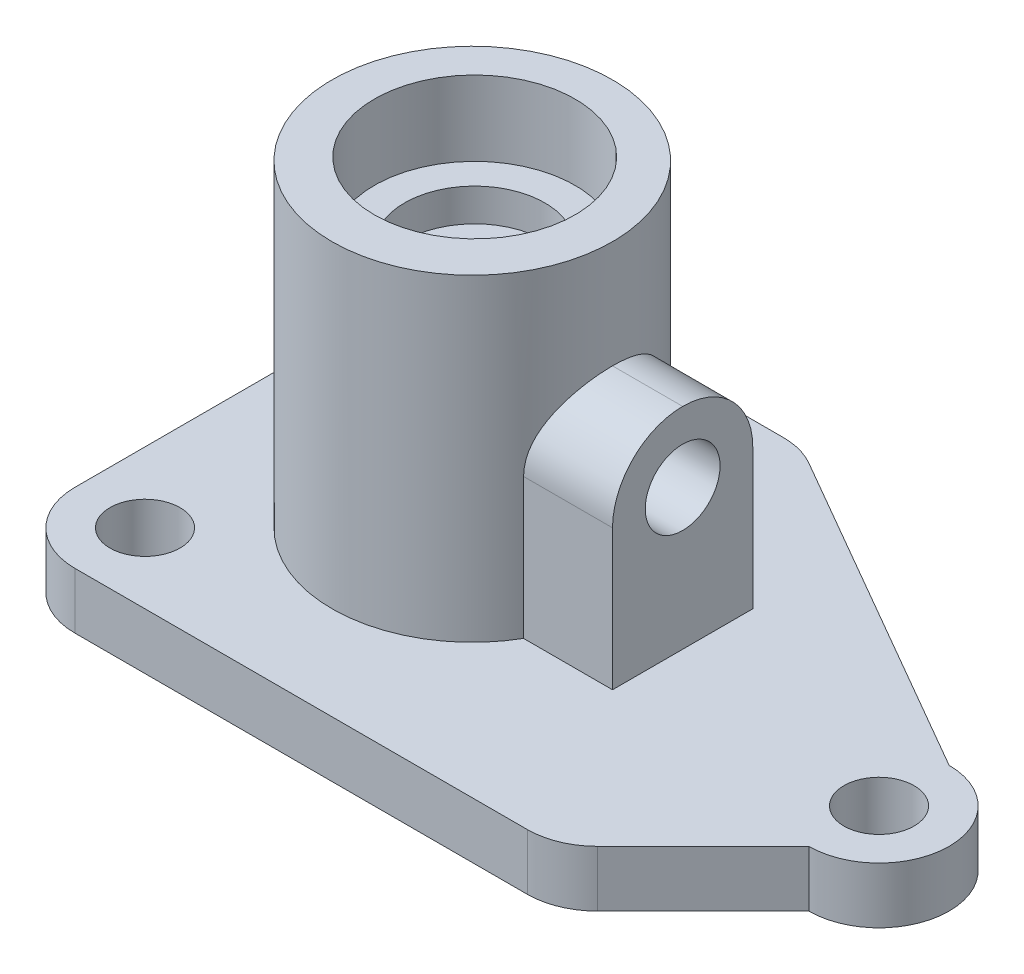
ISO-10303-21;
HEADER;
FILE_DESCRIPTION(('STEP AP214'),'2;1');
FILE_NAME('part.step','',(''),(''),'','','');
FILE_SCHEMA(('AUTOMOTIVE_DESIGN { 1 0 10303 214 1 1 1 1 }'));
ENDSEC;
DATA;
#1=APPLICATION_CONTEXT('core data for automotive mechanical design processes');
#2=APPLICATION_PROTOCOL_DEFINITION('international standard','automotive_design',2000,#1);
#3=PRODUCT_CONTEXT('',#1,'mechanical');
#4=PRODUCT('Part','Part','',(#3));
#5=PRODUCT_RELATED_PRODUCT_CATEGORY('part','',(#4));
#6=PRODUCT_DEFINITION_FORMATION('','',#4);
#7=PRODUCT_DEFINITION_CONTEXT('part definition',#1,'design');
#8=PRODUCT_DEFINITION('design','',#6,#7);
#9=PRODUCT_DEFINITION_SHAPE('','',#8);
#10=(LENGTH_UNIT() NAMED_UNIT(*) SI_UNIT(.MILLI.,.METRE.));
#11=(NAMED_UNIT(*) PLANE_ANGLE_UNIT() SI_UNIT($,.RADIAN.));
#12=(NAMED_UNIT(*) SI_UNIT($,.STERADIAN.) SOLID_ANGLE_UNIT());
#13=UNCERTAINTY_MEASURE_WITH_UNIT(LENGTH_MEASURE(1.E-05),#10,'distance_accuracy_value','');
#14=(GEOMETRIC_REPRESENTATION_CONTEXT(3) GLOBAL_UNCERTAINTY_ASSIGNED_CONTEXT((#13)) GLOBAL_UNIT_ASSIGNED_CONTEXT((#10,
#11,#12)) REPRESENTATION_CONTEXT('',''));
#15=CARTESIAN_POINT('',(0.,0.,0.));
#16=DIRECTION('',(0.,0.,1.));
#17=DIRECTION('',(1.,0.,0.));
#18=AXIS2_PLACEMENT_3D('',#15,#16,#17);
#19=CARTESIAN_POINT('',(49.557906347323,-6.00000000000001,-50.9678122259524));
#20=DIRECTION('',(0.,1.,0.));
#21=DIRECTION('',(0.,0.,1.));
#22=AXIS2_PLACEMENT_3D('',#19,#20,#21);
#23=CYLINDRICAL_SURFACE('',#22,15.);
#24=CARTESIAN_POINT('',(49.557906347323,-6.00000000000001,-50.9678122259524));
#25=DIRECTION('',(0.,1.,0.));
#26=DIRECTION('',(0.,0.,1.));
#27=AXIS2_PLACEMENT_3D('',#24,#25,#26);
#28=CIRCLE('',#27,15.);
#29=CARTESIAN_POINT('',(49.557906347323,-6.00000000000001,-35.9678122259524));
#30=VERTEX_POINT('',#29);
#31=EDGE_CURVE('E192',#30,#30,#28,.T.);
#32=ORIENTED_EDGE('',*,*,#31,.F.);
#33=EDGE_LOOP('',(#32));
#34=FACE_BOUND('',#33,.T.);
#35=CARTESIAN_POINT('',(49.557906347323,6.,-50.9678122259524));
#36=DIRECTION('',(0.,1.,0.));
#37=DIRECTION('',(0.,0.,1.));
#38=AXIS2_PLACEMENT_3D('',#35,#36,#37);
#39=CIRCLE('',#38,15.);
#40=CARTESIAN_POINT('',(49.557906347323,6.,-35.9678122259524));
#41=VERTEX_POINT('',#40);
#42=EDGE_CURVE('E175',#41,#41,#39,.F.);
#43=ORIENTED_EDGE('',*,*,#42,.F.);
#44=EDGE_LOOP('',(#43));
#45=FACE_BOUND('',#44,.T.);
#46=ADVANCED_FACE('F41',(#34,#45),#23,.F.);
#47=CARTESIAN_POINT('',(15.,6.,-15.));
#48=DIRECTION('',(0.,-1.,0.));
#49=DIRECTION('',(0.,0.,-1.));
#50=AXIS2_PLACEMENT_3D('',#47,#48,#49);
#51=PLANE('',#50);
#52=CARTESIAN_POINT('',(15.,6.,-15.));
#53=DIRECTION('',(0.,1.,0.));
#54=DIRECTION('',(0.,0.,1.));
#55=AXIS2_PLACEMENT_3D('',#52,#53,#54);
#56=CIRCLE('',#55,7.5);
#57=CARTESIAN_POINT('',(15.,6.,-7.5));
#58=VERTEX_POINT('',#57);
#59=EDGE_CURVE('E380',#58,#58,#56,.T.);
#60=ORIENTED_EDGE('',*,*,#59,.F.);
#61=EDGE_LOOP('',(#60));
#62=FACE_BOUND('',#61,.T.);
#63=CARTESIAN_POINT('',(15.,6.,-85.));
#64=DIRECTION('',(0.,1.,0.));
#65=DIRECTION('',(0.,0.,1.));
#66=AXIS2_PLACEMENT_3D('',#63,#64,#65);
#67=CIRCLE('',#66,7.5);
#68=CARTESIAN_POINT('',(15.,6.,-77.5));
#69=VERTEX_POINT('',#68);
#70=EDGE_CURVE('E387',#69,#69,#67,.T.);
#71=ORIENTED_EDGE('',*,*,#70,.F.);
#72=EDGE_LOOP('',(#71));
#73=FACE_BOUND('',#72,.T.);
#74=CARTESIAN_POINT('',(145.,6.,-42.));
#75=DIRECTION('',(0.,1.,0.));
#76=DIRECTION('',(0.,0.,1.));
#77=AXIS2_PLACEMENT_3D('',#74,#75,#76);
#78=CIRCLE('',#77,7.50000000000001);
#79=CARTESIAN_POINT('',(145.,6.,-34.5));
#80=VERTEX_POINT('',#79);
#81=EDGE_CURVE('E395',#80,#80,#78,.T.);
#82=ORIENTED_EDGE('',*,*,#81,.F.);
#83=EDGE_LOOP('',(#82));
#84=FACE_BOUND('',#83,.T.);
#85=CARTESIAN_POINT('',(15.,6.,-15.));
#86=DIRECTION('',(0.,1.,0.));
#87=DIRECTION('',(0.,0.,-1.));
#88=AXIS2_PLACEMENT_3D('',#85,#86,#87);
#89=CIRCLE('',#88,15.);
#90=CARTESIAN_POINT('',(0.,6.,-15.0000000000001));
#91=VERTEX_POINT('',#90);
#92=CARTESIAN_POINT('',(15.0000000000001,6.,0.));
#93=VERTEX_POINT('',#92);
#94=EDGE_CURVE('E403',#91,#93,#89,.T.);
#95=ORIENTED_EDGE('',*,*,#94,.T.);
#96=DIRECTION('',(1.,0.,0.));
#97=VECTOR('',#96,1.);
#98=CARTESIAN_POINT('',(15.0000000000001,6.,0.));
#99=LINE('',#98,#97);
#100=CARTESIAN_POINT('',(111.786796564404,6.,0.));
#101=VERTEX_POINT('',#100);
#102=EDGE_CURVE('E407',#93,#101,#99,.T.);
#103=ORIENTED_EDGE('',*,*,#102,.T.);
#104=CARTESIAN_POINT('',(111.786796564404,6.,-15.));
#105=DIRECTION('',(0.,1.,0.));
#106=DIRECTION('',(0.,0.,-1.));
#107=AXIS2_PLACEMENT_3D('',#104,#105,#106);
#108=CIRCLE('',#107,15.);
#109=CARTESIAN_POINT('',(122.393398282202,6.,-4.3933982822018));
#110=VERTEX_POINT('',#109);
#111=EDGE_CURVE('E411',#101,#110,#108,.T.);
#112=ORIENTED_EDGE('',*,*,#111,.T.);
#113=DIRECTION('',(0.707106781186546,0.,-0.707106781186549));
#114=VECTOR('',#113,1.);
#115=CARTESIAN_POINT('',(122.393398282202,6.,-4.39339828220181));
#116=LINE('',#115,#114);
#117=CARTESIAN_POINT('',(145.,6.,-27.));
#118=VERTEX_POINT('',#117);
#119=EDGE_CURVE('E414',#110,#118,#116,.T.);
#120=ORIENTED_EDGE('',*,*,#119,.T.);
#121=CARTESIAN_POINT('',(145.,6.,-42.));
#122=DIRECTION('',(0.,1.,0.));
#123=DIRECTION('',(0.,0.,1.));
#124=AXIS2_PLACEMENT_3D('',#121,#122,#123);
#125=CIRCLE('',#124,15.);
#126=CARTESIAN_POINT('',(145.,6.,-57.));
#127=VERTEX_POINT('',#126);
#128=EDGE_CURVE('E417',#118,#127,#125,.T.);
#129=ORIENTED_EDGE('',*,*,#128,.T.);
#130=DIRECTION('',(-0.866025403784438,0.,-0.500000000000001));
#131=VECTOR('',#130,1.);
#132=CARTESIAN_POINT('',(74.0025773880716,6.,-97.9903810567666));
#133=LINE('',#132,#131);
#134=CARTESIAN_POINT('',(74.0025773880716,6.,-97.9903810567666));
#135=VERTEX_POINT('',#134);
#136=EDGE_CURVE('E420',#127,#135,#133,.T.);
#137=ORIENTED_EDGE('',*,*,#136,.T.);
#138=CARTESIAN_POINT('',(66.5025773880716,6.,-85.));
#139=DIRECTION('',(0.,1.,0.));
#140=DIRECTION('',(0.,0.,1.));
#141=AXIS2_PLACEMENT_3D('',#138,#139,#140);
#142=CIRCLE('',#141,15.);
#143=CARTESIAN_POINT('',(66.5025773880716,6.,-100.));
#144=VERTEX_POINT('',#143);
#145=EDGE_CURVE('E423',#135,#144,#142,.T.);
#146=ORIENTED_EDGE('',*,*,#145,.T.);
#147=DIRECTION('',(-1.,0.,0.));
#148=VECTOR('',#147,1.);
#149=CARTESIAN_POINT('',(15.0000000000001,6.,-100.));
#150=LINE('',#149,#148);
#151=CARTESIAN_POINT('',(15.0000000000001,6.,-100.));
#152=VERTEX_POINT('',#151);
#153=EDGE_CURVE('E426',#144,#152,#150,.T.);
#154=ORIENTED_EDGE('',*,*,#153,.T.);
#155=CARTESIAN_POINT('',(15.,6.,-85.));
#156=DIRECTION('',(0.,1.,0.));
#157=DIRECTION('',(0.,0.,1.));
#158=AXIS2_PLACEMENT_3D('',#155,#156,#157);
#159=CIRCLE('',#158,15.);
#160=CARTESIAN_POINT('',(0.,6.,-84.9999999999999));
#161=VERTEX_POINT('',#160);
#162=EDGE_CURVE('E429',#152,#161,#159,.T.);
#163=ORIENTED_EDGE('',*,*,#162,.T.);
#164=DIRECTION('',(0.,0.,1.));
#165=VECTOR('',#164,1.);
#166=CARTESIAN_POINT('',(0.,6.,-15.0000000000001));
#167=LINE('',#166,#165);
#168=EDGE_CURVE('E432',#161,#91,#167,.T.);
#169=ORIENTED_EDGE('',*,*,#168,.T.);
#170=EDGE_LOOP('',(#95,#103,#112,#120,#129,#137,#146,#154,#163,#169));
#171=FACE_BOUND('',#170,.T.);
#172=DIRECTION('',(1.,0.,0.));
#173=VECTOR('',#172,1.);
#174=CARTESIAN_POINT('',(95.,6.,-35.));
#175=LINE('',#174,#173);
#176=CARTESIAN_POINT('',(75.9807621135331,6.,-35.));
#177=VERTEX_POINT('',#176);
#178=CARTESIAN_POINT('',(95.,6.,-35.));
#179=VERTEX_POINT('',#178);
#180=EDGE_CURVE('E152',#177,#179,#175,.T.);
#181=ORIENTED_EDGE('',*,*,#180,.F.);
#182=CARTESIAN_POINT('',(50.,6.00000000000001,-50.));
#183=DIRECTION('',(0.,-1.,0.));
#184=DIRECTION('',(0.,0.,-1.));
#185=AXIS2_PLACEMENT_3D('',#182,#183,#184);
#186=CIRCLE('',#185,30.);
#187=CARTESIAN_POINT('',(75.9807621135332,6.,-65.));
#188=VERTEX_POINT('',#187);
#189=EDGE_CURVE('E163',#188,#177,#186,.F.);
#190=ORIENTED_EDGE('',*,*,#189,.F.);
#191=DIRECTION('',(-1.,0.,0.));
#192=VECTOR('',#191,1.);
#193=CARTESIAN_POINT('',(75.9807621135332,6.,-65.));
#194=LINE('',#193,#192);
#195=CARTESIAN_POINT('',(95.,6.,-65.));
#196=VERTEX_POINT('',#195);
#197=EDGE_CURVE('E354',#196,#188,#194,.T.);
#198=ORIENTED_EDGE('',*,*,#197,.F.);
#199=DIRECTION('',(0.,0.,-1.));
#200=VECTOR('',#199,1.);
#201=CARTESIAN_POINT('',(95.,6.,-65.));
#202=LINE('',#201,#200);
#203=EDGE_CURVE('E165',#179,#196,#202,.T.);
#204=ORIENTED_EDGE('',*,*,#203,.F.);
#205=EDGE_LOOP('',(#181,#190,#198,#204));
#206=FACE_BOUND('',#205,.T.);
#207=ADVANCED_FACE('F161',(#62,#73,#84,#171,#206),#51,.F.);
#208=CARTESIAN_POINT('',(49.557906347323,51.,-50.9678122259524));
#209=DIRECTION('',(0.,1.,0.));
#210=DIRECTION('',(0.,0.,1.));
#211=AXIS2_PLACEMENT_3D('',#208,#209,#210);
#212=CIRCLE('',#211,15.);
#213=CARTESIAN_POINT('',(49.557906347323,51.,-35.9678122259524));
#214=VERTEX_POINT('',#213);
#215=EDGE_CURVE('E156',#214,#214,#212,.F.);
#216=ORIENTED_EDGE('',*,*,#215,.T.);
#217=EDGE_LOOP('',(#216));
#218=FACE_BOUND('',#217,.T.);
#219=CARTESIAN_POINT('',(49.557906347323,58.,-50.9678122259524));
#220=DIRECTION('',(0.,1.,0.));
#221=DIRECTION('',(0.,0.,1.));
#222=AXIS2_PLACEMENT_3D('',#219,#220,#221);
#223=CIRCLE('',#222,15.);
#224=CARTESIAN_POINT('',(49.557906347323,58.,-35.9678122259524));
#225=VERTEX_POINT('',#224);
#226=EDGE_CURVE('E188',#225,#225,#223,.F.);
#227=ORIENTED_EDGE('',*,*,#226,.F.);
#228=EDGE_LOOP('',(#227));
#229=FACE_BOUND('',#228,.T.);
#230=ADVANCED_FACE('F268',(#218,#229),#23,.F.);
#231=CARTESIAN_POINT('',(15.,-6.,-15.));
#232=DIRECTION('',(0.,-1.,0.));
#233=DIRECTION('',(0.,0.,-1.));
#234=AXIS2_PLACEMENT_3D('',#231,#232,#233);
#235=PLANE('',#234);
#236=ORIENTED_EDGE('',*,*,#31,.T.);
#237=EDGE_LOOP('',(#236));
#238=FACE_BOUND('',#237,.T.);
#239=CARTESIAN_POINT('',(15.,-6.,-85.));
#240=DIRECTION('',(0.,1.,0.));
#241=DIRECTION('',(0.,0.,1.));
#242=AXIS2_PLACEMENT_3D('',#239,#240,#241);
#243=CIRCLE('',#242,7.5);
#244=CARTESIAN_POINT('',(15.,-6.,-77.5));
#245=VERTEX_POINT('',#244);
#246=EDGE_CURVE('E383',#245,#245,#243,.T.);
#247=ORIENTED_EDGE('',*,*,#246,.T.);
#248=EDGE_LOOP('',(#247));
#249=FACE_BOUND('',#248,.T.);
#250=CARTESIAN_POINT('',(15.,-6.,-15.));
#251=DIRECTION('',(0.,1.,0.));
#252=DIRECTION('',(0.,0.,-1.));
#253=AXIS2_PLACEMENT_3D('',#250,#251,#252);
#254=CIRCLE('',#253,15.);
#255=CARTESIAN_POINT('',(0.,-6.,-15.0000000000001));
#256=VERTEX_POINT('',#255);
#257=CARTESIAN_POINT('',(15.0000000000001,-6.,0.));
#258=VERTEX_POINT('',#257);
#259=EDGE_CURVE('E399',#256,#258,#254,.T.);
#260=ORIENTED_EDGE('',*,*,#259,.F.);
#261=DIRECTION('',(0.,0.,1.));
#262=VECTOR('',#261,1.);
#263=CARTESIAN_POINT('',(0.,-6.,-15.0000000000001));
#264=LINE('',#263,#262);
#265=CARTESIAN_POINT('',(0.,-6.,-84.9999999999999));
#266=VERTEX_POINT('',#265);
#267=EDGE_CURVE('E408',#266,#256,#264,.T.);
#268=ORIENTED_EDGE('',*,*,#267,.F.);
#269=CARTESIAN_POINT('',(15.,-6.,-85.));
#270=DIRECTION('',(0.,1.,0.));
#271=DIRECTION('',(0.,0.,1.));
#272=AXIS2_PLACEMENT_3D('',#269,#270,#271);
#273=CIRCLE('',#272,15.);
#274=CARTESIAN_POINT('',(15.0000000000001,-6.,-100.));
#275=VERTEX_POINT('',#274);
#276=EDGE_CURVE('E460',#275,#266,#273,.T.);
#277=ORIENTED_EDGE('',*,*,#276,.F.);
#278=DIRECTION('',(-1.,0.,0.));
#279=VECTOR('',#278,1.);
#280=CARTESIAN_POINT('',(15.0000000000001,-6.,-100.));
#281=LINE('',#280,#279);
#282=CARTESIAN_POINT('',(66.5025773880716,-6.,-100.));
#283=VERTEX_POINT('',#282);
#284=EDGE_CURVE('E457',#283,#275,#281,.T.);
#285=ORIENTED_EDGE('',*,*,#284,.F.);
#286=CARTESIAN_POINT('',(66.5025773880716,-6.,-85.));
#287=DIRECTION('',(0.,1.,0.));
#288=DIRECTION('',(0.,0.,1.));
#289=AXIS2_PLACEMENT_3D('',#286,#287,#288);
#290=CIRCLE('',#289,15.);
#291=CARTESIAN_POINT('',(74.0025773880716,-6.,-97.9903810567666));
#292=VERTEX_POINT('',#291);
#293=EDGE_CURVE('E454',#292,#283,#290,.T.);
#294=ORIENTED_EDGE('',*,*,#293,.F.);
#295=DIRECTION('',(-0.866025403784438,0.,-0.500000000000001));
#296=VECTOR('',#295,1.);
#297=CARTESIAN_POINT('',(74.0025773880716,-6.,-97.9903810567666));
#298=LINE('',#297,#296);
#299=CARTESIAN_POINT('',(145.,-6.,-57.));
#300=VERTEX_POINT('',#299);
#301=EDGE_CURVE('E451',#300,#292,#298,.T.);
#302=ORIENTED_EDGE('',*,*,#301,.F.);
#303=CARTESIAN_POINT('',(145.,-6.,-42.));
#304=DIRECTION('',(0.,1.,0.));
#305=DIRECTION('',(0.,0.,1.));
#306=AXIS2_PLACEMENT_3D('',#303,#304,#305);
#307=CIRCLE('',#306,15.);
#308=CARTESIAN_POINT('',(145.,-6.,-27.));
#309=VERTEX_POINT('',#308);
#310=EDGE_CURVE('E448',#309,#300,#307,.T.);
#311=ORIENTED_EDGE('',*,*,#310,.F.);
#312=DIRECTION('',(0.707106781186546,0.,-0.707106781186549));
#313=VECTOR('',#312,1.);
#314=CARTESIAN_POINT('',(122.393398282202,-6.,-4.39339828220181));
#315=LINE('',#314,#313);
#316=CARTESIAN_POINT('',(122.393398282202,-6.,-4.3933982822018));
#317=VERTEX_POINT('',#316);
#318=EDGE_CURVE('E445',#317,#309,#315,.T.);
#319=ORIENTED_EDGE('',*,*,#318,.F.);
#320=CARTESIAN_POINT('',(111.786796564404,-6.,-15.));
#321=DIRECTION('',(0.,1.,0.));
#322=DIRECTION('',(0.,0.,-1.));
#323=AXIS2_PLACEMENT_3D('',#320,#321,#322);
#324=CIRCLE('',#323,15.);
#325=CARTESIAN_POINT('',(111.786796564404,-6.,0.));
#326=VERTEX_POINT('',#325);
#327=EDGE_CURVE('E442',#326,#317,#324,.T.);
#328=ORIENTED_EDGE('',*,*,#327,.F.);
#329=DIRECTION('',(1.,0.,0.));
#330=VECTOR('',#329,1.);
#331=CARTESIAN_POINT('',(15.0000000000001,-6.,0.));
#332=LINE('',#331,#330);
#333=EDGE_CURVE('E439',#258,#326,#332,.T.);
#334=ORIENTED_EDGE('',*,*,#333,.F.);
#335=EDGE_LOOP('',(#260,#268,#277,#285,#294,#302,#311,#319,#328,#334));
#336=FACE_BOUND('',#335,.T.);
#337=CARTESIAN_POINT('',(145.,-6.,-42.));
#338=DIRECTION('',(0.,1.,0.));
#339=DIRECTION('',(0.,0.,1.));
#340=AXIS2_PLACEMENT_3D('',#337,#338,#339);
#341=CIRCLE('',#340,7.50000000000001);
#342=CARTESIAN_POINT('',(145.,-6.,-34.5));
#343=VERTEX_POINT('',#342);
#344=EDGE_CURVE('E391',#343,#343,#341,.T.);
#345=ORIENTED_EDGE('',*,*,#344,.T.);
#346=EDGE_LOOP('',(#345));
#347=FACE_BOUND('',#346,.T.);
#348=CARTESIAN_POINT('',(15.,-6.,-15.));
#349=DIRECTION('',(0.,1.,0.));
#350=DIRECTION('',(0.,0.,1.));
#351=AXIS2_PLACEMENT_3D('',#348,#349,#350);
#352=CIRCLE('',#351,7.5);
#353=CARTESIAN_POINT('',(15.,-6.,-7.5));
#354=VERTEX_POINT('',#353);
#355=EDGE_CURVE('E379',#354,#354,#352,.T.);
#356=ORIENTED_EDGE('',*,*,#355,.T.);
#357=EDGE_LOOP('',(#356));
#358=FACE_BOUND('',#357,.T.);
#359=ADVANCED_FACE('F228',(#238,#249,#336,#347,#358),#235,.T.);
#360=CARTESIAN_POINT('',(15.,6.,-15.));
#361=DIRECTION('',(0.,-1.,0.));
#362=DIRECTION('',(0.,0.,-1.));
#363=AXIS2_PLACEMENT_3D('',#360,#361,#362);
#364=CYLINDRICAL_SURFACE('',#363,15.);
#365=ORIENTED_EDGE('',*,*,#259,.T.);
#366=DIRECTION('',(0.,-1.,0.));
#367=VECTOR('',#366,1.);
#368=CARTESIAN_POINT('',(15.0000000000001,6.,0.));
#369=LINE('',#368,#367);
#370=EDGE_CURVE('E176',#93,#258,#369,.T.);
#371=ORIENTED_EDGE('',*,*,#370,.F.);
#372=ORIENTED_EDGE('',*,*,#94,.F.);
#373=DIRECTION('',(0.,-1.,0.));
#374=VECTOR('',#373,1.);
#375=CARTESIAN_POINT('',(0.,6.,-15.0000000000001));
#376=LINE('',#375,#374);
#377=EDGE_CURVE('E435',#91,#256,#376,.T.);
#378=ORIENTED_EDGE('',*,*,#377,.T.);
#379=EDGE_LOOP('',(#365,#371,#372,#378));
#380=FACE_BOUND('',#379,.T.);
#381=ADVANCED_FACE('F224',(#380),#364,.T.);
#382=CARTESIAN_POINT('',(15.0000000000001,6.,0.));
#383=DIRECTION('',(0.,0.,-1.));
#384=DIRECTION('',(-1.,0.,0.));
#385=AXIS2_PLACEMENT_3D('',#382,#383,#384);
#386=PLANE('',#385);
#387=ORIENTED_EDGE('',*,*,#333,.T.);
#388=DIRECTION('',(0.,-1.,0.));
#389=VECTOR('',#388,1.);
#390=CARTESIAN_POINT('',(111.786796564404,6.,0.));
#391=LINE('',#390,#389);
#392=EDGE_CURVE('E184',#101,#326,#391,.T.);
#393=ORIENTED_EDGE('',*,*,#392,.F.);
#394=ORIENTED_EDGE('',*,*,#102,.F.);
#395=ORIENTED_EDGE('',*,*,#370,.T.);
#396=EDGE_LOOP('',(#387,#393,#394,#395));
#397=FACE_BOUND('',#396,.T.);
#398=ADVANCED_FACE('F227',(#397),#386,.F.);
#399=CARTESIAN_POINT('',(111.786796564404,6.,-15.));
#400=DIRECTION('',(0.,-1.,0.));
#401=DIRECTION('',(0.,0.,-1.));
#402=AXIS2_PLACEMENT_3D('',#399,#400,#401);
#403=CYLINDRICAL_SURFACE('',#402,15.);
#404=ORIENTED_EDGE('',*,*,#327,.T.);
#405=DIRECTION('',(0.,-1.,0.));
#406=VECTOR('',#405,1.);
#407=CARTESIAN_POINT('',(122.393398282202,6.,-4.3933982822018));
#408=LINE('',#407,#406);
#409=EDGE_CURVE('E492',#110,#317,#408,.T.);
#410=ORIENTED_EDGE('',*,*,#409,.F.);
#411=ORIENTED_EDGE('',*,*,#111,.F.);
#412=ORIENTED_EDGE('',*,*,#392,.T.);
#413=EDGE_LOOP('',(#404,#410,#411,#412));
#414=FACE_BOUND('',#413,.T.);
#415=ADVANCED_FACE('F232',(#414),#403,.T.);
#416=CARTESIAN_POINT('',(122.393398282202,6.,-4.39339828220181));
#417=DIRECTION('',(-0.707106781186549,0.,-0.707106781186546));
#418=DIRECTION('',(-0.707106781186546,0.,0.707106781186549));
#419=AXIS2_PLACEMENT_3D('',#416,#417,#418);
#420=PLANE('',#419);
#421=ORIENTED_EDGE('',*,*,#318,.T.);
#422=DIRECTION('',(0.,-1.,0.));
#423=VECTOR('',#422,1.);
#424=CARTESIAN_POINT('',(145.,6.,-27.));
#425=LINE('',#424,#423);
#426=EDGE_CURVE('E488',#118,#309,#425,.T.);
#427=ORIENTED_EDGE('',*,*,#426,.F.);
#428=ORIENTED_EDGE('',*,*,#119,.F.);
#429=ORIENTED_EDGE('',*,*,#409,.T.);
#430=EDGE_LOOP('',(#421,#427,#428,#429));
#431=FACE_BOUND('',#430,.T.);
#432=ADVANCED_FACE('F236',(#431),#420,.F.);
#433=CARTESIAN_POINT('',(145.,6.,-42.));
#434=DIRECTION('',(0.,-1.,0.));
#435=DIRECTION('',(0.,0.,-1.));
#436=AXIS2_PLACEMENT_3D('',#433,#434,#435);
#437=CYLINDRICAL_SURFACE('',#436,15.);
#438=ORIENTED_EDGE('',*,*,#310,.T.);
#439=DIRECTION('',(0.,-1.,0.));
#440=VECTOR('',#439,1.);
#441=CARTESIAN_POINT('',(145.,6.,-57.));
#442=LINE('',#441,#440);
#443=EDGE_CURVE('E484',#127,#300,#442,.T.);
#444=ORIENTED_EDGE('',*,*,#443,.F.);
#445=ORIENTED_EDGE('',*,*,#128,.F.);
#446=ORIENTED_EDGE('',*,*,#426,.T.);
#447=EDGE_LOOP('',(#438,#444,#445,#446));
#448=FACE_BOUND('',#447,.T.);
#449=ADVANCED_FACE('F240',(#448),#437,.T.);
#450=CARTESIAN_POINT('',(74.0025773880716,6.,-97.9903810567666));
#451=DIRECTION('',(-0.500000000000001,0.,0.866025403784438));
#452=DIRECTION('',(0.866025403784438,0.,0.500000000000001));
#453=AXIS2_PLACEMENT_3D('',#450,#451,#452);
#454=PLANE('',#453);
#455=ORIENTED_EDGE('',*,*,#301,.T.);
#456=DIRECTION('',(0.,-1.,0.));
#457=VECTOR('',#456,1.);
#458=CARTESIAN_POINT('',(74.0025773880716,6.,-97.9903810567666));
#459=LINE('',#458,#457);
#460=EDGE_CURVE('E480',#135,#292,#459,.T.);
#461=ORIENTED_EDGE('',*,*,#460,.F.);
#462=ORIENTED_EDGE('',*,*,#136,.F.);
#463=ORIENTED_EDGE('',*,*,#443,.T.);
#464=EDGE_LOOP('',(#455,#461,#462,#463));
#465=FACE_BOUND('',#464,.T.);
#466=ADVANCED_FACE('F244',(#465),#454,.F.);
#467=CARTESIAN_POINT('',(66.5025773880716,6.,-85.));
#468=DIRECTION('',(0.,-1.,0.));
#469=DIRECTION('',(0.,0.,-1.));
#470=AXIS2_PLACEMENT_3D('',#467,#468,#469);
#471=CYLINDRICAL_SURFACE('',#470,15.);
#472=ORIENTED_EDGE('',*,*,#293,.T.);
#473=DIRECTION('',(0.,-1.,0.));
#474=VECTOR('',#473,1.);
#475=CARTESIAN_POINT('',(66.5025773880716,6.,-100.));
#476=LINE('',#475,#474);
#477=EDGE_CURVE('E476',#144,#283,#476,.T.);
#478=ORIENTED_EDGE('',*,*,#477,.F.);
#479=ORIENTED_EDGE('',*,*,#145,.F.);
#480=ORIENTED_EDGE('',*,*,#460,.T.);
#481=EDGE_LOOP('',(#472,#478,#479,#480));
#482=FACE_BOUND('',#481,.T.);
#483=ADVANCED_FACE('F248',(#482),#471,.T.);
#484=CARTESIAN_POINT('',(15.0000000000001,6.,-100.));
#485=DIRECTION('',(0.,0.,1.));
#486=DIRECTION('',(1.,0.,0.));
#487=AXIS2_PLACEMENT_3D('',#484,#485,#486);
#488=PLANE('',#487);
#489=ORIENTED_EDGE('',*,*,#284,.T.);
#490=DIRECTION('',(0.,-1.,0.));
#491=VECTOR('',#490,1.);
#492=CARTESIAN_POINT('',(15.0000000000001,6.,-100.));
#493=LINE('',#492,#491);
#494=EDGE_CURVE('E472',#152,#275,#493,.T.);
#495=ORIENTED_EDGE('',*,*,#494,.F.);
#496=ORIENTED_EDGE('',*,*,#153,.F.);
#497=ORIENTED_EDGE('',*,*,#477,.T.);
#498=EDGE_LOOP('',(#489,#495,#496,#497));
#499=FACE_BOUND('',#498,.T.);
#500=ADVANCED_FACE('F252',(#499),#488,.F.);
#501=CARTESIAN_POINT('',(15.,6.,-85.));
#502=DIRECTION('',(0.,-1.,0.));
#503=DIRECTION('',(0.,0.,-1.));
#504=AXIS2_PLACEMENT_3D('',#501,#502,#503);
#505=CYLINDRICAL_SURFACE('',#504,15.);
#506=ORIENTED_EDGE('',*,*,#276,.T.);
#507=DIRECTION('',(0.,-1.,0.));
#508=VECTOR('',#507,1.);
#509=CARTESIAN_POINT('',(0.,6.,-84.9999999999999));
#510=LINE('',#509,#508);
#511=EDGE_CURVE('E468',#161,#266,#510,.T.);
#512=ORIENTED_EDGE('',*,*,#511,.F.);
#513=ORIENTED_EDGE('',*,*,#162,.F.);
#514=ORIENTED_EDGE('',*,*,#494,.T.);
#515=EDGE_LOOP('',(#506,#512,#513,#514));
#516=FACE_BOUND('',#515,.T.);
#517=ADVANCED_FACE('F256',(#516),#505,.T.);
#518=CARTESIAN_POINT('',(0.,6.,-15.0000000000001));
#519=DIRECTION('',(1.,0.,0.));
#520=DIRECTION('',(0.,0.,-1.));
#521=AXIS2_PLACEMENT_3D('',#518,#519,#520);
#522=PLANE('',#521);
#523=ORIENTED_EDGE('',*,*,#267,.T.);
#524=ORIENTED_EDGE('',*,*,#377,.F.);
#525=ORIENTED_EDGE('',*,*,#168,.F.);
#526=ORIENTED_EDGE('',*,*,#511,.T.);
#527=EDGE_LOOP('',(#523,#524,#525,#526));
#528=FACE_BOUND('',#527,.T.);
#529=ADVANCED_FACE('F260',(#528),#522,.F.);
#530=CARTESIAN_POINT('',(145.,6.,-42.));
#531=DIRECTION('',(0.,-1.,0.));
#532=DIRECTION('',(0.,0.,-1.));
#533=AXIS2_PLACEMENT_3D('',#530,#531,#532);
#534=CYLINDRICAL_SURFACE('',#533,7.50000000000001);
#535=ORIENTED_EDGE('',*,*,#81,.T.);
#536=EDGE_LOOP('',(#535));
#537=FACE_BOUND('',#536,.T.);
#538=ORIENTED_EDGE('',*,*,#344,.F.);
#539=EDGE_LOOP('',(#538));
#540=FACE_BOUND('',#539,.T.);
#541=ADVANCED_FACE('F264',(#537,#540),#534,.F.);
#542=CARTESIAN_POINT('',(15.,6.,-85.));
#543=DIRECTION('',(0.,-1.,0.));
#544=DIRECTION('',(0.,0.,-1.));
#545=AXIS2_PLACEMENT_3D('',#542,#543,#544);
#546=CYLINDRICAL_SURFACE('',#545,7.5);
#547=ORIENTED_EDGE('',*,*,#70,.T.);
#548=EDGE_LOOP('',(#547));
#549=FACE_BOUND('',#548,.T.);
#550=ORIENTED_EDGE('',*,*,#246,.F.);
#551=EDGE_LOOP('',(#550));
#552=FACE_BOUND('',#551,.T.);
#553=ADVANCED_FACE('F275',(#549,#552),#546,.F.);
#554=CARTESIAN_POINT('',(15.,6.,-15.));
#555=DIRECTION('',(0.,-1.,0.));
#556=DIRECTION('',(0.,0.,-1.));
#557=AXIS2_PLACEMENT_3D('',#554,#555,#556);
#558=CYLINDRICAL_SURFACE('',#557,7.5);
#559=ORIENTED_EDGE('',*,*,#59,.T.);
#560=EDGE_LOOP('',(#559));
#561=FACE_BOUND('',#560,.T.);
#562=ORIENTED_EDGE('',*,*,#355,.F.);
#563=EDGE_LOOP('',(#562));
#564=FACE_BOUND('',#563,.T.);
#565=ADVANCED_FACE('F278',(#561,#564),#558,.F.);
#566=CARTESIAN_POINT('',(50.,74.,-50.));
#567=DIRECTION('',(0.,-1.,0.));
#568=DIRECTION('',(0.,0.,-1.));
#569=AXIS2_PLACEMENT_3D('',#566,#567,#568);
#570=CYLINDRICAL_SURFACE('',#569,30.);
#571=DIRECTION('',(0.,-1.,0.));
#572=VECTOR('',#571,1.);
#573=CARTESIAN_POINT('',(75.9807621135331,51.,-35.));
#574=LINE('',#573,#572);
#575=CARTESIAN_POINT('',(75.9807621135331,36.,-35.));
#576=VERTEX_POINT('',#575);
#577=EDGE_CURVE('E149',#576,#177,#574,.T.);
#578=ORIENTED_EDGE('',*,*,#577,.F.);
#579=CARTESIAN_POINT('',(75.9807621135331,36.,-35.));
#580=CARTESIAN_POINT('',(75.9807576052739,36.1964294300005,-34.9999985413133));
#581=CARTESIAN_POINT('',(75.9829907255559,36.392831099822,-35.0038592992464));
#582=CARTESIAN_POINT('',(75.9918860165844,36.7852233778562,-35.0192798302831));
#583=CARTESIAN_POINT('',(75.9985480000364,36.9812140031002,-35.0308392778125));
#584=CARTESIAN_POINT('',(76.0250931881294,37.56772869252,-35.077001868887));
#585=CARTESIAN_POINT('',(76.0515357858172,37.9571304063804,-35.1230893553027));
#586=CARTESIAN_POINT('',(76.1207229325683,38.7273741744684,-35.2449106954974));
#587=CARTESIAN_POINT('',(76.1633717927487,39.1082528355326,-35.3204705992371));
#588=CARTESIAN_POINT('',(76.2634675389025,39.8612150286426,-35.5003156058474));
#589=CARTESIAN_POINT('',(76.3209161235126,40.2332975457564,-35.6046040061234));
#590=CARTESIAN_POINT('',(76.4485620502384,40.9654973264601,-35.8404984546806));
#591=CARTESIAN_POINT('',(76.5187314057458,41.3256388433824,-35.972044623013));
#592=CARTESIAN_POINT('',(76.6697625604938,42.0328773621423,-36.2613547638628));
#593=CARTESIAN_POINT('',(76.7506242247779,42.3799745285522,-36.4191184054747));
#594=CARTESIAN_POINT('',(76.9208959850134,43.0599689941914,-36.7598465960842));
#595=CARTESIAN_POINT('',(77.0103173126027,43.3928467840709,-36.9428443988627));
#596=CARTESIAN_POINT('',(77.1953498714776,44.0426433246775,-37.3327383068068));
#597=CARTESIAN_POINT('',(77.2909633763256,44.3595561367915,-37.5396432119848));
#598=CARTESIAN_POINT('',(77.4940396372751,45.0012366589475,-37.9939753136343));
#599=CARTESIAN_POINT('',(77.6018326738733,45.3245354944899,-38.2433313866168));
#600=CARTESIAN_POINT('',(77.8191523993081,45.9494258648215,-38.7672272647687));
#601=CARTESIAN_POINT('',(77.9286791764777,46.2510162892108,-39.0417683565374));
#602=CARTESIAN_POINT('',(78.1467937550466,46.8311720344219,-39.6148173076038));
#603=CARTESIAN_POINT('',(78.2553810990948,47.1097266495456,-39.9133361847419));
#604=CARTESIAN_POINT('',(78.4688989193131,47.6420632495032,-40.5327369358127));
#605=CARTESIAN_POINT('',(78.5738306114735,47.8958535233506,-40.8536112649611));
#606=CARTESIAN_POINT('',(78.7845187286064,48.3936599167613,-41.5389949288834));
#607=CARTESIAN_POINT('',(78.8898415403146,48.6358230850805,-41.9049876842316));
#608=CARTESIAN_POINT('',(79.090548547241,49.0882052679398,-42.6588740263125));
#609=CARTESIAN_POINT('',(79.1859317752518,49.2984211746462,-43.0467697387396));
#610=CARTESIAN_POINT('',(79.3638837825136,49.6845531218925,-43.8414379169642));
#611=CARTESIAN_POINT('',(79.446469736697,49.8605152164704,-44.2481841140316));
#612=CARTESIAN_POINT('',(79.5964914074544,50.1764471841637,-45.0780752388264));
#613=CARTESIAN_POINT('',(79.6639310456597,50.3164263752073,-45.501215888414));
#614=CARTESIAN_POINT('',(79.7676947326545,50.5300429479919,-46.2591092959807));
#615=CARTESIAN_POINT('',(79.8076061044672,50.6115406453741,-46.5911800880489));
#616=CARTESIAN_POINT('',(79.8766139486151,50.7518059511655,-47.2611474528789));
#617=CARTESIAN_POINT('',(79.9057128177777,50.8105785971963,-47.5990427171206));
#618=CARTESIAN_POINT('',(79.9525788290477,50.9049910483236,-48.2796806641032));
#619=CARTESIAN_POINT('',(79.9703179724478,50.9405737000344,-48.6224332118474));
#620=CARTESIAN_POINT('',(79.9940518658652,50.9881023450218,-49.3101165552196));
#621=CARTESIAN_POINT('',(80.0000417825239,51.0000386107455,-49.6550481887604));
#622=CARTESIAN_POINT('',(80.,51.,-50.));
#623=B_SPLINE_CURVE_WITH_KNOTS('',3,(#579,#580,#581,#582,#583,#584,#585,#586,#587,#588,#589,
#590,#591,#592,#593,#594,#595,#596,#597,#598,#599,#600,#601,#602,#603,#604,#605,#606,#607,#608,
#609,#610,#611,#612,#613,#614,#615,#616,#617,#618,#619,#620,#621,#622),.UNSPECIFIED.,.F.,.F.,(4,
2,2,2,2,2,2,2,2,2,2,2,2,2,2,2,2,2,2,2,2,4),(0.,0.589182830167556,1.17834074563152,
2.35565578315216,3.52612481172429,4.69672824065464,5.86478684154365,7.03283070082328,
8.20242879572011,9.37245879007017,10.6379539276934,11.9035137503154,13.1696584640021,
14.4353779149056,15.7875879420586,17.1399294282846,18.4904399479275,19.8406003939457,
20.8724353185444,21.9040413777441,22.9381803838133,23.9727447214653),.UNSPECIFIED.);
#624=CARTESIAN_POINT('',(80.,51.,-50.));
#625=VERTEX_POINT('',#624);
#626=EDGE_CURVE('E11',#576,#625,#623,.T.);
#627=ORIENTED_EDGE('',*,*,#626,.T.);
#628=CARTESIAN_POINT('',(80.,51.,-50.));
#629=CARTESIAN_POINT('',(80.0000023634762,51.0000010687787,-50.1979987069068));
#630=CARTESIAN_POINT('',(79.9980391876463,50.9960788454996,-50.3959708045015));
#631=CARTESIAN_POINT('',(79.9902085551638,50.980409728898,-50.7915193001843));
#632=CARTESIAN_POINT('',(79.9843412672327,50.9686631737146,-50.9890957150024));
#633=CARTESIAN_POINT('',(79.9609329197252,50.9217389084121,-51.5804971793011));
#634=CARTESIAN_POINT('',(79.9375853096568,50.8748765394925,-51.9732425135635));
#635=CARTESIAN_POINT('',(79.8761524850768,50.7508425106681,-52.7508207078131));
#636=CARTESIAN_POINT('',(79.8381351822429,50.6738104934567,-53.1356815465192));
#637=CARTESIAN_POINT('',(79.7483198642942,50.4903048712947,-53.8966989175619));
#638=CARTESIAN_POINT('',(79.6965209963494,50.3838294443128,-54.2728549096593));
#639=CARTESIAN_POINT('',(79.5804881515566,50.1427163255377,-55.0134891840763));
#640=CARTESIAN_POINT('',(79.5162700838221,50.008114646171,-55.377981718521));
#641=CARTESIAN_POINT('',(79.3768621639733,49.7119327194576,-56.0936778846328));
#642=CARTESIAN_POINT('',(79.3016713680742,49.550350151262,-56.4448803699226));
#643=CARTESIAN_POINT('',(79.1419527951946,49.2014199835826,-57.1324093000886));
#644=CARTESIAN_POINT('',(79.0574169424428,49.0140500644994,-57.4687225209862));
#645=CARTESIAN_POINT('',(78.8809080582174,48.6150252969299,-58.1245611652585));
#646=CARTESIAN_POINT('',(78.7889347424725,48.4033695200711,-58.4440859461823));
#647=CARTESIAN_POINT('',(78.5938459493331,47.9437795141632,-59.083516724332));
#648=CARTESIAN_POINT('',(78.4903930803827,47.6944334243737,-59.4023053000982));
#649=CARTESIAN_POINT('',(78.2797370336501,47.1714291914554,-60.018104758924));
#650=CARTESIAN_POINT('',(78.1725326803291,46.8977633855587,-60.3151087237972));
#651=CARTESIAN_POINT('',(77.9568735322879,46.3274631573312,-60.8860647875124));
#652=CARTESIAN_POINT('',(77.8484180328202,46.0308151920147,-61.1600030926936));
#653=CARTESIAN_POINT('',(77.6329457188363,45.4160797718601,-61.683338962854));
#654=CARTESIAN_POINT('',(77.525929027113,45.0979905009003,-61.9327344445944));
#655=CARTESIAN_POINT('',(77.307799620699,44.4159580182018,-62.424248481268));
#656=CARTESIAN_POINT('',(77.197027096145,44.0503761549055,-62.664250689733));
#657=CARTESIAN_POINT('',(76.9838883085722,43.2979655841582,-63.1122581100541));
#658=CARTESIAN_POINT('',(76.8815186536258,42.9111455560494,-63.3202762625932));
#659=CARTESIAN_POINT('',(76.6888424496087,42.1189576380444,-63.7022404837634));
#660=CARTESIAN_POINT('',(76.5985160365711,41.7136218087837,-63.8762428842472));
#661=CARTESIAN_POINT('',(76.4331923413078,40.8864769442668,-64.1886445464115));
#662=CARTESIAN_POINT('',(76.3581906767486,40.4646726596151,-64.3270539893484));
#663=CARTESIAN_POINT('',(76.2425067742334,39.7111286740878,-64.5375910018286));
#664=CARTESIAN_POINT('',(76.1979097536916,39.3821839255876,-64.6176535374873));
#665=CARTESIAN_POINT('',(76.1205046151498,38.7183473622228,-64.7555233084195));
#666=CARTESIAN_POINT('',(76.0876935893719,38.3834570356458,-64.8133360332995));
#667=CARTESIAN_POINT('',(76.0346869575169,37.7083095062202,-64.9063114646875));
#668=CARTESIAN_POINT('',(76.014537337515,37.3680372894151,-64.941391621031));
#669=CARTESIAN_POINT('',(75.9875369611709,36.6851875957873,-64.9882637057545));
#670=CARTESIAN_POINT('',(75.9806933943335,36.3426089730211,-65.0000430443346));
#671=CARTESIAN_POINT('',(75.9807621135332,36.,-65.));
#672=B_SPLINE_CURVE_WITH_KNOTS('',3,(#628,#629,#630,#631,#632,#633,#634,#635,#636,#637,#638,
#639,#640,#641,#642,#643,#644,#645,#646,#647,#648,#649,#650,#651,#652,#653,#654,#655,#656,#657,
#658,#659,#660,#661,#662,#663,#664,#665,#666,#667,#668,#669,#670,#671),.UNSPECIFIED.,.F.,.F.,(4,
2,2,2,2,2,2,2,2,2,2,2,2,2,2,2,2,2,2,2,2,4),(0.,0.593894765437593,1.18776386656806,
2.37476050047017,3.55632674725109,4.73796612865929,5.91810172711026,7.09833889110716,
8.27960408059517,9.46091444121701,10.7127917094744,11.9650648330866,13.2180815960454,
14.4712046257334,15.8229208046474,17.1740886346344,18.5229995441679,19.8715241715852,
20.8950340926139,21.9182913250035,22.9452438546245,23.9727511115242),.UNSPECIFIED.);
#673=CARTESIAN_POINT('',(75.9807621135332,36.,-65.));
#674=VERTEX_POINT('',#673);
#675=EDGE_CURVE('E52',#625,#674,#672,.T.);
#676=ORIENTED_EDGE('',*,*,#675,.T.);
#677=DIRECTION('',(0.,-1.,0.));
#678=VECTOR('',#677,1.);
#679=CARTESIAN_POINT('',(75.9807621135332,51.,-65.));
#680=LINE('',#679,#678);
#681=EDGE_CURVE('E172',#674,#188,#680,.T.);
#682=ORIENTED_EDGE('',*,*,#681,.T.);
#683=ORIENTED_EDGE('',*,*,#189,.T.);
#684=EDGE_LOOP('',(#578,#627,#676,#682,#683));
#685=FACE_BOUND('',#684,.T.);
#686=CARTESIAN_POINT('',(50.,74.,-50.));
#687=DIRECTION('',(0.,1.,0.));
#688=DIRECTION('',(0.,0.,1.));
#689=AXIS2_PLACEMENT_3D('',#686,#687,#688);
#690=CIRCLE('',#689,30.);
#691=CARTESIAN_POINT('',(50.,74.,-20.));
#692=VERTEX_POINT('',#691);
#693=EDGE_CURVE('E375',#692,#692,#690,.T.);
#694=ORIENTED_EDGE('',*,*,#693,.F.);
#695=EDGE_LOOP('',(#694));
#696=FACE_BOUND('',#695,.T.);
#697=ADVANCED_FACE('F169',(#685,#696),#570,.T.);
#698=CARTESIAN_POINT('',(50.,74.,-50.));
#699=DIRECTION('',(0.,1.,0.));
#700=DIRECTION('',(0.,0.,1.));
#701=AXIS2_PLACEMENT_3D('',#698,#699,#700);
#702=PLANE('',#701);
#703=CARTESIAN_POINT('',(49.557906347323,74.,-50.9678122259524));
#704=DIRECTION('',(0.,1.,0.));
#705=DIRECTION('',(0.,0.,1.));
#706=AXIS2_PLACEMENT_3D('',#703,#704,#705);
#707=CIRCLE('',#706,21.4721614235503);
#708=CARTESIAN_POINT('',(49.557906347323,74.,-29.4956508024021));
#709=VERTEX_POINT('',#708);
#710=EDGE_CURVE('E366',#709,#709,#707,.T.);
#711=ORIENTED_EDGE('',*,*,#710,.F.);
#712=EDGE_LOOP('',(#711));
#713=FACE_BOUND('',#712,.T.);
#714=ORIENTED_EDGE('',*,*,#693,.T.);
#715=EDGE_LOOP('',(#714));
#716=FACE_BOUND('',#715,.T.);
#717=ADVANCED_FACE('F285',(#713,#716),#702,.T.);
#718=CARTESIAN_POINT('',(49.557906347323,58.,-50.9678122259524));
#719=DIRECTION('',(0.,1.,0.));
#720=DIRECTION('',(0.,0.,1.));
#721=AXIS2_PLACEMENT_3D('',#718,#719,#720);
#722=PLANE('',#721);
#723=CARTESIAN_POINT('',(49.557906347323,58.,-50.9678122259524));
#724=DIRECTION('',(0.,1.,0.));
#725=DIRECTION('',(0.,0.,1.));
#726=AXIS2_PLACEMENT_3D('',#723,#724,#725);
#727=CIRCLE('',#726,21.4721614235503);
#728=CARTESIAN_POINT('',(49.557906347323,58.,-29.4956508024021));
#729=VERTEX_POINT('',#728);
#730=EDGE_CURVE('E193',#729,#729,#727,.T.);
#731=ORIENTED_EDGE('',*,*,#730,.T.);
#732=EDGE_LOOP('',(#731));
#733=FACE_BOUND('',#732,.T.);
#734=ORIENTED_EDGE('',*,*,#226,.T.);
#735=EDGE_LOOP('',(#734));
#736=FACE_BOUND('',#735,.T.);
#737=ADVANCED_FACE('F305',(#733,#736),#722,.T.);
#738=CARTESIAN_POINT('',(49.557906347323,58.,-50.9678122259524));
#739=DIRECTION('',(0.,1.,0.));
#740=DIRECTION('',(0.,0.,1.));
#741=AXIS2_PLACEMENT_3D('',#738,#739,#740);
#742=CYLINDRICAL_SURFACE('',#741,21.4721614235503);
#743=ORIENTED_EDGE('',*,*,#730,.F.);
#744=EDGE_LOOP('',(#743));
#745=FACE_BOUND('',#744,.T.);
#746=ORIENTED_EDGE('',*,*,#710,.T.);
#747=EDGE_LOOP('',(#746));
#748=FACE_BOUND('',#747,.T.);
#749=ADVANCED_FACE('F307',(#745,#748),#742,.F.);
#750=CARTESIAN_POINT('',(75.9807621135332,51.,-65.));
#751=DIRECTION('',(0.,0.,1.));
#752=DIRECTION('',(1.,0.,0.));
#753=AXIS2_PLACEMENT_3D('',#750,#751,#752);
#754=PLANE('',#753);
#755=ORIENTED_EDGE('',*,*,#681,.F.);
#756=DIRECTION('',(-1.,0.,0.));
#757=VECTOR('',#756,1.);
#758=CARTESIAN_POINT('',(95.,36.,-65.));
#759=LINE('',#758,#757);
#760=CARTESIAN_POINT('',(95.,36.,-65.));
#761=VERTEX_POINT('',#760);
#762=EDGE_CURVE('E181',#674,#761,#759,.F.);
#763=ORIENTED_EDGE('',*,*,#762,.T.);
#764=DIRECTION('',(0.,-1.,0.));
#765=VECTOR('',#764,1.);
#766=CARTESIAN_POINT('',(95.,51.,-65.));
#767=LINE('',#766,#765);
#768=EDGE_CURVE('E359',#761,#196,#767,.T.);
#769=ORIENTED_EDGE('',*,*,#768,.T.);
#770=ORIENTED_EDGE('',*,*,#197,.T.);
#771=EDGE_LOOP('',(#755,#763,#769,#770));
#772=FACE_BOUND('',#771,.T.);
#773=ADVANCED_FACE('F314',(#772),#754,.F.);
#774=CARTESIAN_POINT('',(95.,51.,-35.));
#775=DIRECTION('',(0.,0.,-1.));
#776=DIRECTION('',(-1.,0.,0.));
#777=AXIS2_PLACEMENT_3D('',#774,#775,#776);
#778=PLANE('',#777);
#779=DIRECTION('',(0.,-1.,0.));
#780=VECTOR('',#779,1.);
#781=CARTESIAN_POINT('',(95.,51.,-35.));
#782=LINE('',#781,#780);
#783=CARTESIAN_POINT('',(95.,36.,-35.));
#784=VERTEX_POINT('',#783);
#785=EDGE_CURVE('E157',#784,#179,#782,.T.);
#786=ORIENTED_EDGE('',*,*,#785,.F.);
#787=DIRECTION('',(1.,0.,0.));
#788=VECTOR('',#787,1.);
#789=CARTESIAN_POINT('',(75.9807621135331,36.,-35.));
#790=LINE('',#789,#788);
#791=EDGE_CURVE('E66',#784,#576,#790,.F.);
#792=ORIENTED_EDGE('',*,*,#791,.T.);
#793=ORIENTED_EDGE('',*,*,#577,.T.);
#794=ORIENTED_EDGE('',*,*,#180,.T.);
#795=EDGE_LOOP('',(#786,#792,#793,#794));
#796=FACE_BOUND('',#795,.T.);
#797=ADVANCED_FACE('F151',(#796),#778,.F.);
#798=CARTESIAN_POINT('',(95.,51.,-65.));
#799=DIRECTION('',(-1.,0.,0.));
#800=DIRECTION('',(0.,0.,1.));
#801=AXIS2_PLACEMENT_3D('',#798,#799,#800);
#802=PLANE('',#801);
#803=CARTESIAN_POINT('',(95.,36.,-50.));
#804=DIRECTION('',(-1.,0.,0.));
#805=DIRECTION('',(0.,0.,1.));
#806=AXIS2_PLACEMENT_3D('',#803,#804,#805);
#807=CIRCLE('',#806,8.);
#808=CARTESIAN_POINT('',(95.,36.,-42.));
#809=VERTEX_POINT('',#808);
#810=EDGE_CURVE('E46',#809,#809,#807,.T.);
#811=ORIENTED_EDGE('',*,*,#810,.T.);
#812=EDGE_LOOP('',(#811));
#813=FACE_BOUND('',#812,.T.);
#814=ORIENTED_EDGE('',*,*,#768,.F.);
#815=CARTESIAN_POINT('',(95.,36.,-50.));
#816=DIRECTION('',(-1.,0.,0.));
#817=DIRECTION('',(0.,0.,1.));
#818=AXIS2_PLACEMENT_3D('',#815,#816,#817);
#819=CIRCLE('',#818,15.);
#820=CARTESIAN_POINT('',(95.,51.,-50.));
#821=VERTEX_POINT('',#820);
#822=EDGE_CURVE('E200',#761,#821,#819,.F.);
#823=ORIENTED_EDGE('',*,*,#822,.T.);
#824=CARTESIAN_POINT('',(95.,36.,-50.));
#825=DIRECTION('',(-1.,0.,0.));
#826=DIRECTION('',(0.,0.,1.));
#827=AXIS2_PLACEMENT_3D('',#824,#825,#826);
#828=CIRCLE('',#827,15.);
#829=EDGE_CURVE('E197',#821,#784,#828,.F.);
#830=ORIENTED_EDGE('',*,*,#829,.T.);
#831=ORIENTED_EDGE('',*,*,#785,.T.);
#832=ORIENTED_EDGE('',*,*,#203,.T.);
#833=EDGE_LOOP('',(#814,#823,#830,#831,#832));
#834=FACE_BOUND('',#833,.T.);
#835=ADVANCED_FACE('F321',(#813,#834),#802,.F.);
#836=CARTESIAN_POINT('',(50.,6.,-50.));
#837=DIRECTION('',(0.,1.,0.));
#838=DIRECTION('',(0.,0.,1.));
#839=AXIS2_PLACEMENT_3D('',#836,#837,#838);
#840=PLANE('',#839);
#841=ORIENTED_EDGE('',*,*,#42,.T.);
#842=EDGE_LOOP('',(#841));
#843=FACE_BOUND('',#842,.T.);
#844=ADVANCED_FACE('F324',(#843),#840,.F.);
#845=CARTESIAN_POINT('',(50.,51.,-50.));
#846=DIRECTION('',(0.,1.,0.));
#847=DIRECTION('',(0.,0.,1.));
#848=AXIS2_PLACEMENT_3D('',#845,#846,#847);
#849=PLANE('',#848);
#850=ORIENTED_EDGE('',*,*,#215,.F.);
#851=EDGE_LOOP('',(#850));
#852=FACE_BOUND('',#851,.T.);
#853=ADVANCED_FACE('F331',(#852),#849,.T.);
#854=CARTESIAN_POINT('',(50.,36.,-50.));
#855=DIRECTION('',(-1.,0.,0.));
#856=DIRECTION('',(0.,0.,1.));
#857=AXIS2_PLACEMENT_3D('',#854,#855,#856);
#858=CYLINDRICAL_SURFACE('',#857,15.);
#859=ORIENTED_EDGE('',*,*,#791,.F.);
#860=ORIENTED_EDGE('',*,*,#829,.F.);
#861=DIRECTION('',(1.,0.,0.));
#862=VECTOR('',#861,1.);
#863=CARTESIAN_POINT('',(95.,51.,-50.));
#864=LINE('',#863,#862);
#865=EDGE_CURVE('E167',#625,#821,#864,.T.);
#866=ORIENTED_EDGE('',*,*,#865,.F.);
#867=ORIENTED_EDGE('',*,*,#626,.F.);
#868=EDGE_LOOP('',(#859,#860,#866,#867));
#869=FACE_BOUND('',#868,.T.);
#870=ADVANCED_FACE('F43',(#869),#858,.T.);
#871=CARTESIAN_POINT('',(50.,36.,-50.));
#872=DIRECTION('',(1.,0.,0.));
#873=DIRECTION('',(0.,0.,-1.));
#874=AXIS2_PLACEMENT_3D('',#871,#872,#873);
#875=CYLINDRICAL_SURFACE('',#874,15.);
#876=ORIENTED_EDGE('',*,*,#822,.F.);
#877=ORIENTED_EDGE('',*,*,#762,.F.);
#878=ORIENTED_EDGE('',*,*,#675,.F.);
#879=ORIENTED_EDGE('',*,*,#865,.T.);
#880=EDGE_LOOP('',(#876,#877,#878,#879));
#881=FACE_BOUND('',#880,.T.);
#882=ADVANCED_FACE('F218',(#881),#875,.T.);
#883=CARTESIAN_POINT('',(77.5,36.,-50.));
#884=DIRECTION('',(1.,0.,0.));
#885=DIRECTION('',(0.,0.,-1.));
#886=AXIS2_PLACEMENT_3D('',#883,#884,#885);
#887=CYLINDRICAL_SURFACE('',#886,8.);
#888=CARTESIAN_POINT('',(77.5,36.,-50.));
#889=DIRECTION('',(1.,0.,0.));
#890=DIRECTION('',(0.,0.,-1.));
#891=AXIS2_PLACEMENT_3D('',#888,#889,#890);
#892=CIRCLE('',#891,8.);
#893=CARTESIAN_POINT('',(77.5,36.,-58.));
#894=VERTEX_POINT('',#893);
#895=EDGE_CURVE('E346',#894,#894,#892,.T.);
#896=ORIENTED_EDGE('',*,*,#895,.F.);
#897=EDGE_LOOP('',(#896));
#898=FACE_BOUND('',#897,.T.);
#899=ORIENTED_EDGE('',*,*,#810,.F.);
#900=EDGE_LOOP('',(#899));
#901=FACE_BOUND('',#900,.T.);
#902=ADVANCED_FACE('F222',(#898,#901),#887,.F.);
#903=CARTESIAN_POINT('',(77.5,36.,-50.));
#904=DIRECTION('',(1.,0.,0.));
#905=DIRECTION('',(0.,0.,-1.));
#906=AXIS2_PLACEMENT_3D('',#903,#904,#905);
#907=PLANE('',#906);
#908=ORIENTED_EDGE('',*,*,#895,.T.);
#909=EDGE_LOOP('',(#908));
#910=FACE_BOUND('',#909,.T.);
#911=ADVANCED_FACE('F338',(#910),#907,.T.);
#912=CLOSED_SHELL('',(#46,#207,#230,#359,#381,#398,#415,#432,#449,#466,#483,#500,#517,#529,#541,
#553,#565,#697,#717,#737,#749,#773,#797,#835,#844,#853,#870,#882,#902,#911));
#913=MANIFOLD_SOLID_BREP('B2',#912);
#914=ADVANCED_BREP_SHAPE_REPRESENTATION('',(#18,#913),#14);
#915=SHAPE_DEFINITION_REPRESENTATION(#9,#914);
ENDSEC;
END-ISO-10303-21;
